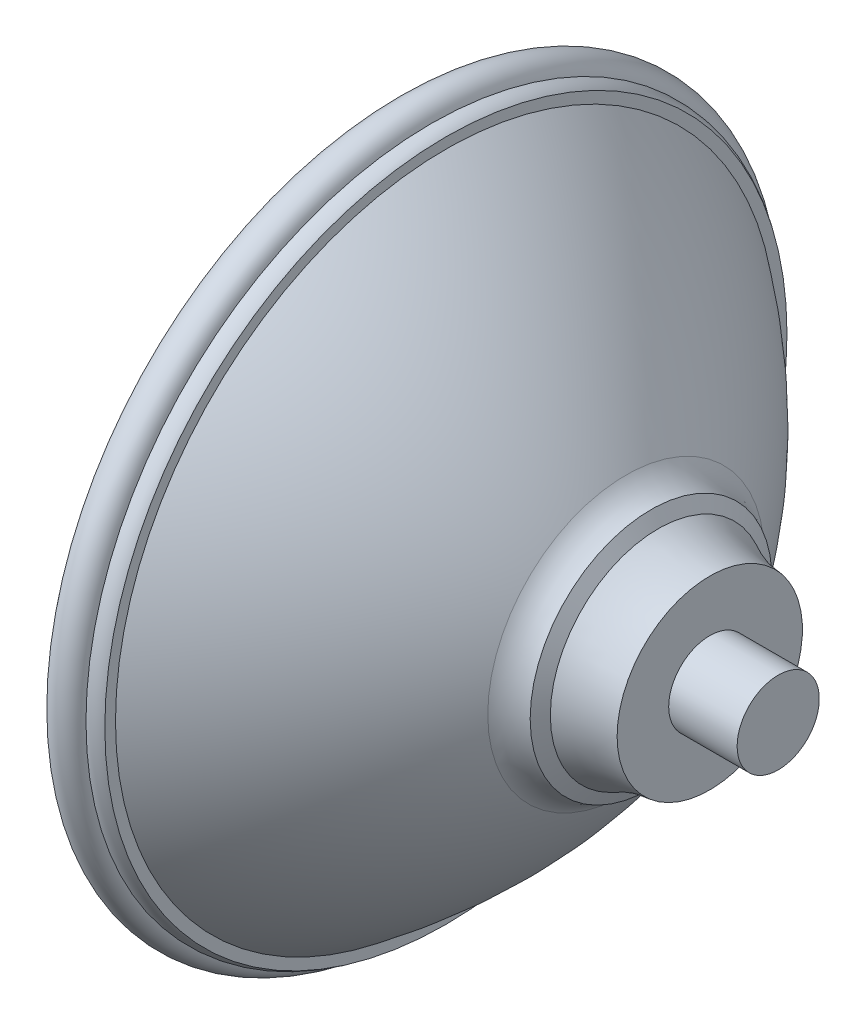
ISO-10303-21;
HEADER;
FILE_DESCRIPTION(('STEP AP214'),'2;1');
FILE_NAME('part.step','',(''),(''),'','','');
FILE_SCHEMA(('AUTOMOTIVE_DESIGN { 1 0 10303 214 1 1 1 1 }'));
ENDSEC;
DATA;
#1=APPLICATION_CONTEXT('core data for automotive mechanical design processes');
#2=APPLICATION_PROTOCOL_DEFINITION('international standard','automotive_design',2000,#1);
#3=PRODUCT_CONTEXT('',#1,'mechanical');
#4=PRODUCT('Part','Part','',(#3));
#5=PRODUCT_RELATED_PRODUCT_CATEGORY('part','',(#4));
#6=PRODUCT_DEFINITION_FORMATION('','',#4);
#7=PRODUCT_DEFINITION_CONTEXT('part definition',#1,'design');
#8=PRODUCT_DEFINITION('design','',#6,#7);
#9=PRODUCT_DEFINITION_SHAPE('','',#8);
#10=(LENGTH_UNIT() NAMED_UNIT(*) SI_UNIT(.MILLI.,.METRE.));
#11=(NAMED_UNIT(*) PLANE_ANGLE_UNIT() SI_UNIT($,.RADIAN.));
#12=(NAMED_UNIT(*) SI_UNIT($,.STERADIAN.) SOLID_ANGLE_UNIT());
#13=UNCERTAINTY_MEASURE_WITH_UNIT(LENGTH_MEASURE(1.E-05),#10,'distance_accuracy_value','');
#14=(GEOMETRIC_REPRESENTATION_CONTEXT(3) GLOBAL_UNCERTAINTY_ASSIGNED_CONTEXT((#13)) GLOBAL_UNIT_ASSIGNED_CONTEXT((#10,
#11,#12)) REPRESENTATION_CONTEXT('',''));
#15=CARTESIAN_POINT('',(0.,0.,0.));
#16=DIRECTION('',(0.,0.,1.));
#17=DIRECTION('',(1.,0.,0.));
#18=AXIS2_PLACEMENT_3D('',#15,#16,#17);
#19=CARTESIAN_POINT('',(73.9769657447427,0.,0.));
#20=DIRECTION('',(-1.,0.,0.));
#21=DIRECTION('',(0.,0.,1.));
#22=AXIS2_PLACEMENT_3D('',#19,#20,#21);
#23=PLANE('',#22);
#24=CARTESIAN_POINT('',(73.9769657447427,0.,0.));
#25=DIRECTION('',(-1.,0.,0.));
#26=DIRECTION('',(0.,0.,1.));
#27=AXIS2_PLACEMENT_3D('',#24,#25,#26);
#28=CIRCLE('',#27,8.29977096166431);
#29=CARTESIAN_POINT('',(73.9769657447427,0.,8.29977096166431));
#30=VERTEX_POINT('',#29);
#31=EDGE_CURVE('E104',#30,#30,#28,.T.);
#32=ORIENTED_EDGE('',*,*,#31,.F.);
#33=EDGE_LOOP('',(#32));
#34=FACE_BOUND('',#33,.T.);
#35=ADVANCED_FACE('F47',(#34),#23,.F.);
#36=CARTESIAN_POINT('',(90.7302732240448,0.,-0.168925291156904));
#37=DIRECTION('',(0.,-1.,0.));
#38=DIRECTION('',(0.,0.,1.));
#39=AXIS2_PLACEMENT_3D('',#36,#37,#38);
#40=CIRCLE('',#39,116.327833508998);
#41=TRIMMED_CURVE('',#40,(PARAMETER_VALUE(-1.56934417776546)),
(PARAMETER_VALUE(1.56934417776546)),.T.,.PARAMETER.);
#42=CARTESIAN_POINT('',(90.7302732240448,0.,0.));
#43=DIRECTION('',(-1.,0.,0.));
#44=AXIS1_PLACEMENT('',#42,#43);
#45=SURFACE_OF_REVOLUTION('',#41,#44);
#46=CARTESIAN_POINT('',(-25.5974376325824,0.,0.));
#47=VERTEX_POINT('',#46);
#48=VERTEX_LOOP('',#47);
#49=FACE_BOUND('',#48,.T.);
#50=CARTESIAN_POINT('',(-3.9595391119564,0.,0.));
#51=DIRECTION('',(-1.,0.,0.));
#52=DIRECTION('',(0.,0.,1.));
#53=AXIS2_PLACEMENT_3D('',#50,#51,#52);
#54=CIRCLE('',#53,67.4032900689297);
#55=CARTESIAN_POINT('',(-3.9595391119564,0.,67.4032900689297));
#56=VERTEX_POINT('',#55);
#57=EDGE_CURVE('E11',#56,#56,#54,.T.);
#58=ORIENTED_EDGE('',*,*,#57,.T.);
#59=EDGE_LOOP('',(#58));
#60=FACE_BOUND('',#59,.T.);
#61=ADVANCED_FACE('F57',(#49,#60),#45,.T.);
#62=CARTESIAN_POINT('',(-17.4451158877121,0.,0.));
#63=DIRECTION('',(-1.,0.,0.));
#64=DIRECTION('',(0.,0.,1.));
#65=AXIS2_PLACEMENT_3D('',#62,#63,#64);
#66=TOROIDAL_SURFACE('',#65,72.9173000717102,14.5693200694324);
#67=ORIENTED_EDGE('',*,*,#57,.F.);
#68=EDGE_LOOP('',(#67));
#69=FACE_BOUND('',#68,.T.);
#70=CARTESIAN_POINT('',(-3.32863422364577,0.,0.));
#71=DIRECTION('',(-1.,0.,0.));
#72=DIRECTION('',(0.,0.,1.));
#73=AXIS2_PLACEMENT_3D('',#70,#71,#72);
#74=CIRCLE('',#73,69.313131275213);
#75=CARTESIAN_POINT('',(-3.32863422364577,0.,69.313131275213));
#76=VERTEX_POINT('',#75);
#77=EDGE_CURVE('E54',#76,#76,#74,.T.);
#78=ORIENTED_EDGE('',*,*,#77,.T.);
#79=EDGE_LOOP('',(#78));
#80=FACE_BOUND('',#79,.T.);
#81=ADVANCED_FACE('F60',(#69,#80),#66,.F.);
#82=CARTESIAN_POINT('',(0.322267612209277,0.,0.));
#83=DIRECTION('',(-1.,0.,0.));
#84=DIRECTION('',(0.,0.,1.));
#85=AXIS2_PLACEMENT_3D('',#82,#83,#84);
#86=TOROIDAL_SURFACE('',#85,68.9006156795988,3.67413300408064);
#87=ORIENTED_EDGE('',*,*,#77,.F.);
#88=EDGE_LOOP('',(#87));
#89=FACE_BOUND('',#88,.T.);
#90=CARTESIAN_POINT('',(3.89600129275297,0.,0.));
#91=DIRECTION('',(-1.,0.,0.));
#92=DIRECTION('',(0.,0.,1.));
#93=AXIS2_PLACEMENT_3D('',#90,#91,#92);
#94=CIRCLE('',#93,69.7536578310909);
#95=CARTESIAN_POINT('',(3.89600129275297,0.,69.7536578310909));
#96=VERTEX_POINT('',#95);
#97=EDGE_CURVE('E71',#96,#96,#94,.T.);
#98=ORIENTED_EDGE('',*,*,#97,.T.);
#99=EDGE_LOOP('',(#98));
#100=FACE_BOUND('',#99,.T.);
#101=ADVANCED_FACE('F65',(#89,#100),#86,.T.);
#102=CARTESIAN_POINT('',(4.30722864346289,0.,0.));
#103=DIRECTION('',(-1.,0.,0.));
#104=DIRECTION('',(0.,0.,1.));
#105=AXIS2_PLACEMENT_3D('',#102,#103,#104);
#106=TOROIDAL_SURFACE('',#105,65.6396194439062,4.13453985168868);
#107=ORIENTED_EDGE('',*,*,#97,.F.);
#108=EDGE_LOOP('',(#107));
#109=FACE_BOUND('',#108,.T.);
#110=CARTESIAN_POINT('',(6.8489452555186,0.,0.));
#111=DIRECTION('',(-1.,0.,0.));
#112=DIRECTION('',(0.,0.,1.));
#113=AXIS2_PLACEMENT_3D('',#110,#111,#112);
#114=CIRCLE('',#113,68.9006156795988);
#115=CARTESIAN_POINT('',(6.8489452555186,0.,68.9006156795988));
#116=VERTEX_POINT('',#115);
#117=EDGE_CURVE('E74',#116,#116,#114,.T.);
#118=ORIENTED_EDGE('',*,*,#117,.T.);
#119=EDGE_LOOP('',(#118));
#120=FACE_BOUND('',#119,.T.);
#121=ADVANCED_FACE('F128',(#109,#120),#106,.T.);
#122=CARTESIAN_POINT('',(6.8489452555186,66.7446261377817,0.));
#123=DIRECTION('',(-1.,0.,0.));
#124=DIRECTION('',(0.,0.,1.));
#125=AXIS2_PLACEMENT_3D('',#122,#123,#124);
#126=PLANE('',#125);
#127=ORIENTED_EDGE('',*,*,#117,.F.);
#128=EDGE_LOOP('',(#127));
#129=FACE_BOUND('',#128,.T.);
#130=CARTESIAN_POINT('',(6.8489452555186,0.,0.));
#131=DIRECTION('',(-1.,0.,0.));
#132=DIRECTION('',(0.,0.,1.));
#133=AXIS2_PLACEMENT_3D('',#130,#131,#132);
#134=CIRCLE('',#133,66.7446261377817);
#135=CARTESIAN_POINT('',(6.8489452555186,0.,66.7446261377817));
#136=VERTEX_POINT('',#135);
#137=EDGE_CURVE('E80',#136,#136,#134,.T.);
#138=ORIENTED_EDGE('',*,*,#137,.T.);
#139=EDGE_LOOP('',(#138));
#140=FACE_BOUND('',#139,.T.);
#141=ADVANCED_FACE('F135',(#129,#140),#126,.F.);
#142=CARTESIAN_POINT('',(-79.644288647668,0.,0.));
#143=DIRECTION('',(-1.,0.,0.));
#144=DIRECTION('',(0.,0.,1.));
#145=AXIS2_PLACEMENT_3D('',#142,#143,#144);
#146=DEGENERATE_TOROIDAL_SURFACE('',#145,50.781651445917,145.922943479468,.F.);
#147=ORIENTED_EDGE('',*,*,#137,.F.);
#148=EDGE_LOOP('',(#147));
#149=FACE_BOUND('',#148,.T.);
#150=CARTESIAN_POINT('',(43.2313175850791,0.,0.));
#151=DIRECTION('',(-1.,0.,0.));
#152=DIRECTION('',(0.,0.,1.));
#153=AXIS2_PLACEMENT_3D('',#150,#151,#152);
#154=CIRCLE('',#153,27.9272478390231);
#155=CARTESIAN_POINT('',(43.2313175850791,0.,27.9272478390231));
#156=VERTEX_POINT('',#155);
#157=EDGE_CURVE('E84',#156,#156,#154,.T.);
#158=ORIENTED_EDGE('',*,*,#157,.T.);
#159=EDGE_LOOP('',(#158));
#160=FACE_BOUND('',#159,.T.);
#161=ADVANCED_FACE('F143',(#149,#160),#146,.F.);
#162=CARTESIAN_POINT('',(50.7030466314063,0.,0.));
#163=DIRECTION('',(-1.,0.,0.));
#164=DIRECTION('',(0.,0.,1.));
#165=AXIS2_PLACEMENT_3D('',#162,#163,#164);
#166=TOROIDAL_SURFACE('',#165,33.3175359973317,9.21313960446341);
#167=ORIENTED_EDGE('',*,*,#157,.F.);
#168=EDGE_LOOP('',(#167));
#169=FACE_BOUND('',#168,.T.);
#170=CARTESIAN_POINT('',(48.2947733115275,0.,0.));
#171=DIRECTION('',(-1.,0.,0.));
#172=DIRECTION('',(0.,0.,1.));
#173=AXIS2_PLACEMENT_3D('',#170,#171,#172);
#174=CIRCLE('',#173,24.4247208644229);
#175=CARTESIAN_POINT('',(48.2947733115275,0.,24.4247208644229));
#176=VERTEX_POINT('',#175);
#177=EDGE_CURVE('E88',#176,#176,#174,.T.);
#178=ORIENTED_EDGE('',*,*,#177,.T.);
#179=EDGE_LOOP('',(#178));
#180=FACE_BOUND('',#179,.T.);
#181=ADVANCED_FACE('F151',(#169,#180),#166,.F.);
#182=CARTESIAN_POINT('',(49.7367035797991,0.,0.));
#183=DIRECTION('',(-1.,0.,0.));
#184=DIRECTION('',(0.,0.,1.));
#185=AXIS2_PLACEMENT_3D('',#182,#183,#184);
#186=CONICAL_SURFACE('',#185,21.7908079340662,1.06991456455931);
#187=ORIENTED_EDGE('',*,*,#177,.F.);
#188=EDGE_LOOP('',(#187));
#189=FACE_BOUND('',#188,.T.);
#190=CARTESIAN_POINT('',(49.7367035797991,0.,0.));
#191=DIRECTION('',(-1.,0.,0.));
#192=DIRECTION('',(0.,0.,1.));
#193=AXIS2_PLACEMENT_3D('',#190,#191,#192);
#194=CIRCLE('',#193,21.7908079340662);
#195=CARTESIAN_POINT('',(49.7367035797991,0.,21.7908079340662));
#196=VERTEX_POINT('',#195);
#197=EDGE_CURVE('E92',#196,#196,#194,.T.);
#198=ORIENTED_EDGE('',*,*,#197,.T.);
#199=EDGE_LOOP('',(#198));
#200=FACE_BOUND('',#199,.T.);
#201=ADVANCED_FACE('F159',(#189,#200),#186,.T.);
#202=CARTESIAN_POINT('',(61.8989088610399,0.,0.));
#203=DIRECTION('',(-1.,0.,0.));
#204=DIRECTION('',(0.,0.,1.));
#205=AXIS2_PLACEMENT_3D('',#202,#203,#204);
#206=TOROIDAL_SURFACE('',#205,43.827484896563,25.1701086380747);
#207=ORIENTED_EDGE('',*,*,#197,.F.);
#208=EDGE_LOOP('',(#207));
#209=FACE_BOUND('',#208,.T.);
#210=CARTESIAN_POINT('',(60.1527528010094,0.,0.));
#211=DIRECTION('',(-1.,0.,0.));
#212=DIRECTION('',(0.,0.,1.));
#213=AXIS2_PLACEMENT_3D('',#210,#211,#212);
#214=CIRCLE('',#213,18.7180183975213);
#215=CARTESIAN_POINT('',(60.1527528010094,0.,18.7180183975213));
#216=VERTEX_POINT('',#215);
#217=EDGE_CURVE('E96',#216,#216,#214,.T.);
#218=ORIENTED_EDGE('',*,*,#217,.T.);
#219=EDGE_LOOP('',(#218));
#220=FACE_BOUND('',#219,.T.);
#221=ADVANCED_FACE('F167',(#209,#220),#206,.F.);
#222=CARTESIAN_POINT('',(60.1527528010094,8.29977096166431,0.));
#223=DIRECTION('',(-1.,0.,0.));
#224=DIRECTION('',(0.,0.,1.));
#225=AXIS2_PLACEMENT_3D('',#222,#223,#224);
#226=PLANE('',#225);
#227=ORIENTED_EDGE('',*,*,#217,.F.);
#228=EDGE_LOOP('',(#227));
#229=FACE_BOUND('',#228,.T.);
#230=CARTESIAN_POINT('',(60.1527528010094,0.,0.));
#231=DIRECTION('',(-1.,0.,0.));
#232=DIRECTION('',(0.,0.,1.));
#233=AXIS2_PLACEMENT_3D('',#230,#231,#232);
#234=CIRCLE('',#233,8.29977096166431);
#235=CARTESIAN_POINT('',(60.1527528010094,0.,8.29977096166431));
#236=VERTEX_POINT('',#235);
#237=EDGE_CURVE('E100',#236,#236,#234,.T.);
#238=ORIENTED_EDGE('',*,*,#237,.T.);
#239=EDGE_LOOP('',(#238));
#240=FACE_BOUND('',#239,.T.);
#241=ADVANCED_FACE('F175',(#229,#240),#226,.F.);
#242=CARTESIAN_POINT('',(0.,0.,0.));
#243=DIRECTION('',(-1.,0.,0.));
#244=DIRECTION('',(0.,0.,1.));
#245=AXIS2_PLACEMENT_3D('',#242,#243,#244);
#246=CYLINDRICAL_SURFACE('',#245,8.29977096166431);
#247=ORIENTED_EDGE('',*,*,#237,.F.);
#248=EDGE_LOOP('',(#247));
#249=FACE_BOUND('',#248,.T.);
#250=ORIENTED_EDGE('',*,*,#31,.T.);
#251=EDGE_LOOP('',(#250));
#252=FACE_BOUND('',#251,.T.);
#253=ADVANCED_FACE('F109',(#249,#252),#246,.T.);
#254=CLOSED_SHELL('',(#35,#61,#81,#101,#121,#141,#161,#181,#201,#221,#241,#253));
#255=MANIFOLD_SOLID_BREP('B2',#254);
#256=ADVANCED_BREP_SHAPE_REPRESENTATION('',(#18,#255),#14);
#257=SHAPE_DEFINITION_REPRESENTATION(#9,#256);
ENDSEC;
END-ISO-10303-21;
